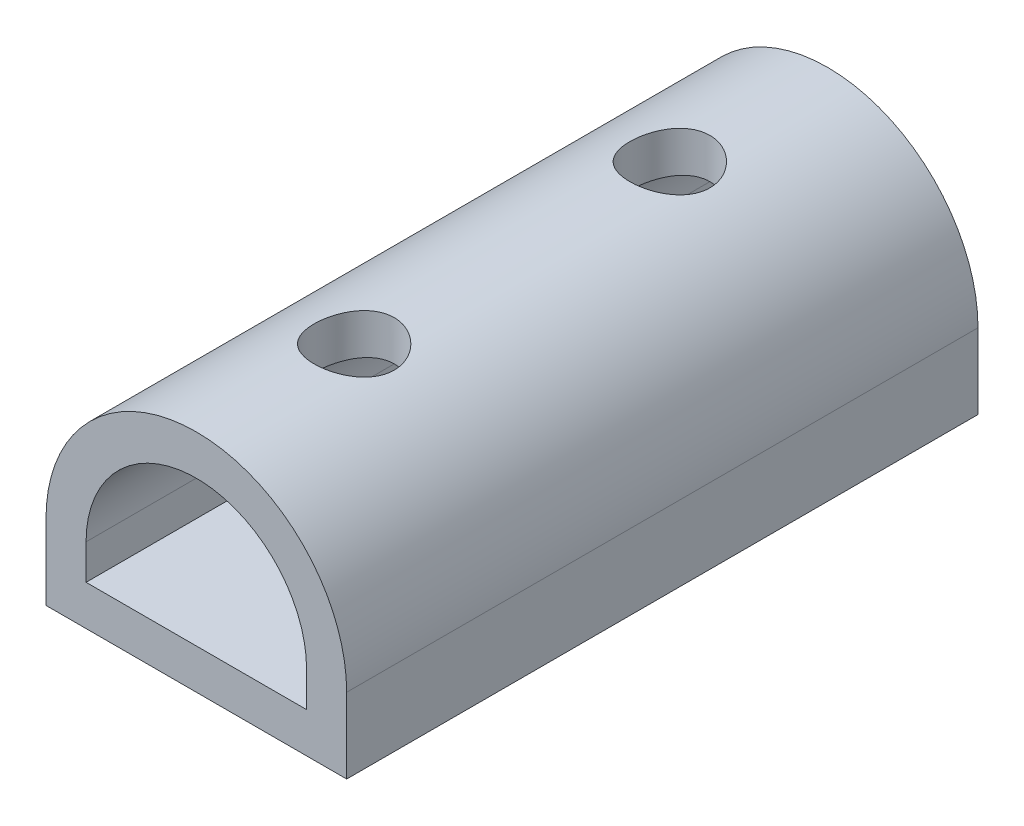
ISO-10303-21;
HEADER;
FILE_DESCRIPTION(('STEP AP214'),'2;1');
FILE_NAME('part.step','',(''),(''),'','','');
FILE_SCHEMA(('AUTOMOTIVE_DESIGN { 1 0 10303 214 1 1 1 1 }'));
ENDSEC;
DATA;
#1=APPLICATION_CONTEXT('core data for automotive mechanical design processes');
#2=APPLICATION_PROTOCOL_DEFINITION('international standard','automotive_design',2000,#1);
#3=PRODUCT_CONTEXT('',#1,'mechanical');
#4=PRODUCT('Part','Part','',(#3));
#5=PRODUCT_RELATED_PRODUCT_CATEGORY('part','',(#4));
#6=PRODUCT_DEFINITION_FORMATION('','',#4);
#7=PRODUCT_DEFINITION_CONTEXT('part definition',#1,'design');
#8=PRODUCT_DEFINITION('design','',#6,#7);
#9=PRODUCT_DEFINITION_SHAPE('','',#8);
#10=(LENGTH_UNIT() NAMED_UNIT(*) SI_UNIT(.MILLI.,.METRE.));
#11=(NAMED_UNIT(*) PLANE_ANGLE_UNIT() SI_UNIT($,.RADIAN.));
#12=(NAMED_UNIT(*) SI_UNIT($,.STERADIAN.) SOLID_ANGLE_UNIT());
#13=UNCERTAINTY_MEASURE_WITH_UNIT(LENGTH_MEASURE(1.E-05),#10,'distance_accuracy_value','');
#14=(GEOMETRIC_REPRESENTATION_CONTEXT(3) GLOBAL_UNCERTAINTY_ASSIGNED_CONTEXT((#13)) GLOBAL_UNIT_ASSIGNED_CONTEXT((#10,
#11,#12)) REPRESENTATION_CONTEXT('',''));
#15=CARTESIAN_POINT('',(0.,0.,0.));
#16=DIRECTION('',(0.,0.,1.));
#17=DIRECTION('',(1.,0.,0.));
#18=AXIS2_PLACEMENT_3D('',#15,#16,#17);
#19=CARTESIAN_POINT('',(0.,0.,20.));
#20=DIRECTION('',(0.,0.,-1.));
#21=DIRECTION('',(-1.,0.,0.));
#22=AXIS2_PLACEMENT_3D('',#19,#20,#21);
#23=PLANE('',#22);
#24=CARTESIAN_POINT('',(0.,0.,20.));
#25=DIRECTION('',(0.,0.,1.));
#26=DIRECTION('',(-1.,0.,0.));
#27=AXIS2_PLACEMENT_3D('',#24,#25,#26);
#28=CIRCLE('',#27,4.7625);
#29=CARTESIAN_POINT('',(4.7625,0.,20.));
#30=VERTEX_POINT('',#29);
#31=CARTESIAN_POINT('',(-4.7625,0.,20.));
#32=VERTEX_POINT('',#31);
#33=EDGE_CURVE('E137',#30,#32,#28,.T.);
#34=ORIENTED_EDGE('',*,*,#33,.T.);
#35=DIRECTION('',(0.,-1.,0.));
#36=VECTOR('',#35,1.);
#37=CARTESIAN_POINT('',(-4.7625,0.,20.));
#38=LINE('',#37,#36);
#39=CARTESIAN_POINT('',(-4.7625,-2.38125,20.));
#40=VERTEX_POINT('',#39);
#41=EDGE_CURVE('E140',#32,#40,#38,.T.);
#42=ORIENTED_EDGE('',*,*,#41,.T.);
#43=DIRECTION('',(1.,0.,0.));
#44=VECTOR('',#43,1.);
#45=CARTESIAN_POINT('',(-4.7625,-2.38125,20.));
#46=LINE('',#45,#44);
#47=CARTESIAN_POINT('',(4.7625,-2.38125,20.));
#48=VERTEX_POINT('',#47);
#49=EDGE_CURVE('E143',#40,#48,#46,.T.);
#50=ORIENTED_EDGE('',*,*,#49,.T.);
#51=DIRECTION('',(0.,1.,0.));
#52=VECTOR('',#51,1.);
#53=CARTESIAN_POINT('',(4.7625,0.,20.));
#54=LINE('',#53,#52);
#55=EDGE_CURVE('E145',#48,#30,#54,.T.);
#56=ORIENTED_EDGE('',*,*,#55,.T.);
#57=EDGE_LOOP('',(#34,#42,#50,#56));
#58=FACE_BOUND('',#57,.T.);
#59=CARTESIAN_POINT('',(0.,0.,20.));
#60=DIRECTION('',(0.,0.,1.));
#61=DIRECTION('',(-1.,0.,0.));
#62=AXIS2_PLACEMENT_3D('',#59,#60,#61);
#63=CIRCLE('',#62,3.4925);
#64=CARTESIAN_POINT('',(3.4925,0.,20.));
#65=VERTEX_POINT('',#64);
#66=CARTESIAN_POINT('',(-3.4925,0.,20.));
#67=VERTEX_POINT('',#66);
#68=EDGE_CURVE('E99',#65,#67,#63,.T.);
#69=ORIENTED_EDGE('',*,*,#68,.F.);
#70=DIRECTION('',(0.,1.,0.));
#71=VECTOR('',#70,1.);
#72=CARTESIAN_POINT('',(3.4925,0.,20.));
#73=LINE('',#72,#71);
#74=CARTESIAN_POINT('',(3.4925,-1.11125,20.));
#75=VERTEX_POINT('',#74);
#76=EDGE_CURVE('E121',#75,#65,#73,.T.);
#77=ORIENTED_EDGE('',*,*,#76,.F.);
#78=DIRECTION('',(1.,0.,0.));
#79=VECTOR('',#78,1.);
#80=CARTESIAN_POINT('',(-3.4925,-1.11125,20.));
#81=LINE('',#80,#79);
#82=CARTESIAN_POINT('',(-3.4925,-1.11125,20.));
#83=VERTEX_POINT('',#82);
#84=EDGE_CURVE('E119',#83,#75,#81,.T.);
#85=ORIENTED_EDGE('',*,*,#84,.F.);
#86=DIRECTION('',(0.,-1.,0.));
#87=VECTOR('',#86,1.);
#88=CARTESIAN_POINT('',(-3.4925,0.,20.));
#89=LINE('',#88,#87);
#90=EDGE_CURVE('E107',#67,#83,#89,.T.);
#91=ORIENTED_EDGE('',*,*,#90,.F.);
#92=EDGE_LOOP('',(#69,#77,#85,#91));
#93=FACE_BOUND('',#92,.T.);
#94=ADVANCED_FACE('F32',(#58,#93),#23,.F.);
#95=CARTESIAN_POINT('',(0.,0.,0.));
#96=DIRECTION('',(0.,0.,-1.));
#97=DIRECTION('',(-1.,0.,0.));
#98=AXIS2_PLACEMENT_3D('',#95,#96,#97);
#99=PLANE('',#98);
#100=CARTESIAN_POINT('',(0.,0.,0.));
#101=DIRECTION('',(0.,0.,1.));
#102=DIRECTION('',(-1.,0.,0.));
#103=AXIS2_PLACEMENT_3D('',#100,#101,#102);
#104=CIRCLE('',#103,4.7625);
#105=CARTESIAN_POINT('',(4.7625,0.,0.));
#106=VERTEX_POINT('',#105);
#107=CARTESIAN_POINT('',(-4.7625,0.,0.));
#108=VERTEX_POINT('',#107);
#109=EDGE_CURVE('E115',#106,#108,#104,.T.);
#110=ORIENTED_EDGE('',*,*,#109,.F.);
#111=DIRECTION('',(0.,1.,0.));
#112=VECTOR('',#111,1.);
#113=CARTESIAN_POINT('',(4.7625,0.,0.));
#114=LINE('',#113,#112);
#115=CARTESIAN_POINT('',(4.7625,-2.38125,0.));
#116=VERTEX_POINT('',#115);
#117=EDGE_CURVE('E141',#116,#106,#114,.T.);
#118=ORIENTED_EDGE('',*,*,#117,.F.);
#119=DIRECTION('',(1.,0.,0.));
#120=VECTOR('',#119,1.);
#121=CARTESIAN_POINT('',(-4.7625,-2.38125,0.));
#122=LINE('',#121,#120);
#123=CARTESIAN_POINT('',(-4.7625,-2.38125,0.));
#124=VERTEX_POINT('',#123);
#125=EDGE_CURVE('E152',#124,#116,#122,.T.);
#126=ORIENTED_EDGE('',*,*,#125,.F.);
#127=DIRECTION('',(0.,-1.,0.));
#128=VECTOR('',#127,1.);
#129=CARTESIAN_POINT('',(-4.7625,0.,0.));
#130=LINE('',#129,#128);
#131=EDGE_CURVE('E150',#108,#124,#130,.T.);
#132=ORIENTED_EDGE('',*,*,#131,.F.);
#133=EDGE_LOOP('',(#110,#118,#126,#132));
#134=FACE_BOUND('',#133,.T.);
#135=DIRECTION('',(0.,1.,0.));
#136=VECTOR('',#135,1.);
#137=CARTESIAN_POINT('',(3.4925,0.,0.));
#138=LINE('',#137,#136);
#139=CARTESIAN_POINT('',(3.4925,-1.11125,0.));
#140=VERTEX_POINT('',#139);
#141=CARTESIAN_POINT('',(3.4925,0.,0.));
#142=VERTEX_POINT('',#141);
#143=EDGE_CURVE('E108',#140,#142,#138,.T.);
#144=ORIENTED_EDGE('',*,*,#143,.T.);
#145=CARTESIAN_POINT('',(0.,0.,0.));
#146=DIRECTION('',(0.,0.,1.));
#147=DIRECTION('',(-1.,0.,0.));
#148=AXIS2_PLACEMENT_3D('',#145,#146,#147);
#149=CIRCLE('',#148,3.4925);
#150=CARTESIAN_POINT('',(-3.4925,0.,0.));
#151=VERTEX_POINT('',#150);
#152=EDGE_CURVE('E57',#142,#151,#149,.T.);
#153=ORIENTED_EDGE('',*,*,#152,.T.);
#154=DIRECTION('',(0.,-1.,0.));
#155=VECTOR('',#154,1.);
#156=CARTESIAN_POINT('',(-3.4925,0.,0.));
#157=LINE('',#156,#155);
#158=CARTESIAN_POINT('',(-3.4925,-1.11125,0.));
#159=VERTEX_POINT('',#158);
#160=EDGE_CURVE('E114',#151,#159,#157,.T.);
#161=ORIENTED_EDGE('',*,*,#160,.T.);
#162=DIRECTION('',(1.,0.,0.));
#163=VECTOR('',#162,1.);
#164=CARTESIAN_POINT('',(-3.4925,-1.11125,0.));
#165=LINE('',#164,#163);
#166=EDGE_CURVE('E129',#159,#140,#165,.T.);
#167=ORIENTED_EDGE('',*,*,#166,.T.);
#168=EDGE_LOOP('',(#144,#153,#161,#167));
#169=FACE_BOUND('',#168,.T.);
#170=ADVANCED_FACE('F218',(#134,#169),#99,.T.);
#171=CARTESIAN_POINT('',(0.,0.,20.));
#172=DIRECTION('',(0.,0.,-1.));
#173=DIRECTION('',(-1.,0.,0.));
#174=AXIS2_PLACEMENT_3D('',#171,#172,#173);
#175=CYLINDRICAL_SURFACE('',#174,4.7625);
#176=CARTESIAN_POINT('',(0.,4.7625,13.730000033));
#177=CARTESIAN_POINT('',(-0.0700116429538607,4.76249894469453,13.7300016947536));
#178=CARTESIAN_POINT('',(-0.140041096740867,4.76094098712968,13.7358087680104));
#179=CARTESIAN_POINT('',(-0.278082661610083,4.75487729249752,13.7588425145191));
#180=CARTESIAN_POINT('',(-0.346093785407618,4.75037013686184,13.7760746833106));
#181=CARTESIAN_POINT('',(-0.478086159043772,4.7389055161553,13.8213585414587));
#182=CARTESIAN_POINT('',(-0.542072481394705,4.73195121127818,13.8493962811679));
#183=CARTESIAN_POINT('',(-0.664434590859336,4.71632723961286,13.9154436820933));
#184=CARTESIAN_POINT('',(-0.722810003735506,4.70765745852329,13.9534540078331));
#185=CARTESIAN_POINT('',(-0.833646734874912,4.68931380462879,14.0392980659225));
#186=CARTESIAN_POINT('',(-0.885959423062883,4.67962276976387,14.0873200371854));
#187=CARTESIAN_POINT('',(-0.981892331745028,4.66043905146116,14.1914218197451));
#188=CARTESIAN_POINT('',(-1.0255114331974,4.65094639369914,14.2475026667866));
#189=CARTESIAN_POINT('',(-1.10354369869575,4.63305866291489,14.3673166621147));
#190=CARTESIAN_POINT('',(-1.13778587362695,4.62468524243723,14.4311647014481));
#191=CARTESIAN_POINT('',(-1.19499093028866,4.61023638090984,14.5639710035418));
#192=CARTESIAN_POINT('',(-1.21795589181525,4.60416051618176,14.6329283213233));
#193=CARTESIAN_POINT('',(-1.2514384434378,4.59517188556697,14.7723496995199));
#194=CARTESIAN_POINT('',(-1.26222550605534,4.59219076442095,14.8427445308696));
#195=CARTESIAN_POINT('',(-1.27188617038369,4.58952492713378,14.9844029619164));
#196=CARTESIAN_POINT('',(-1.27076199813142,4.58983959505736,15.0556663967976));
#197=CARTESIAN_POINT('',(-1.25684603851664,4.59366860518344,15.1949357717615));
#198=CARTESIAN_POINT('',(-1.24438032851112,4.59709352044208,15.2629771435942));
#199=CARTESIAN_POINT('',(-1.20865740438599,4.60661393311852,15.39596592538));
#200=CARTESIAN_POINT('',(-1.18539932778055,4.61270964397422,15.4609130875979));
#201=CARTESIAN_POINT('',(-1.12848616672934,4.62696345208696,15.5867198043184));
#202=CARTESIAN_POINT('',(-1.09471676622492,4.63514403689466,15.6475249884468));
#203=CARTESIAN_POINT('',(-1.017819299281,4.65263375823363,15.7627202238707));
#204=CARTESIAN_POINT('',(-0.974689390623996,4.66194311675655,15.8171090091144));
#205=CARTESIAN_POINT('',(-0.878627956122704,4.68101369249848,15.9197905463838));
#206=CARTESIAN_POINT('',(-0.825422610824696,4.69077974395377,15.96782659513));
#207=CARTESIAN_POINT('',(-0.711592219311044,4.70939102110492,16.0543469085224));
#208=CARTESIAN_POINT('',(-0.650966880820229,4.7182362105024,16.092830796726));
#209=CARTESIAN_POINT('',(-0.523619892240878,4.73406355952908,16.1592674012937));
#210=CARTESIAN_POINT('',(-0.456872913120384,4.74103746249309,16.1871736622349));
#211=CARTESIAN_POINT('',(-0.319406456937899,4.75227678194637,16.2312949978965));
#212=CARTESIAN_POINT('',(-0.248687851574483,4.75654279025931,16.2475126273297));
#213=CARTESIAN_POINT('',(-0.1074763427974,4.76179615684574,16.2673932798428));
#214=CARTESIAN_POINT('',(-0.0370358909022738,4.76287463394061,16.2714053133053));
#215=CARTESIAN_POINT('',(0.103511379147263,4.76189339524225,16.2677247237032));
#216=CARTESIAN_POINT('',(0.173618231034443,4.75983400381017,16.2600333104228));
#217=CARTESIAN_POINT('',(0.310262555687634,4.75286727539979,16.2334504188629));
#218=CARTESIAN_POINT('',(0.376840656037649,4.74800946856943,16.2147536066644));
#219=CARTESIAN_POINT('',(0.505908926696798,4.73599697257755,16.1669167082375));
#220=CARTESIAN_POINT('',(0.56839865315216,4.72884203452476,16.137775490331));
#221=CARTESIAN_POINT('',(0.688872431414171,4.71281544455389,16.0692296146403));
#222=CARTESIAN_POINT('',(0.746744244672928,4.70391290994482,16.0296350915832));
#223=CARTESIAN_POINT('',(0.855144743477116,4.68542022251799,15.9415452478499));
#224=CARTESIAN_POINT('',(0.905671975037205,4.67582993410727,15.8930481690491));
#225=CARTESIAN_POINT('',(0.999419670440502,4.65670738626641,15.7869011912901));
#226=CARTESIAN_POINT('',(1.04239389723741,4.64718439012466,15.7290317465109));
#227=CARTESIAN_POINT('',(1.11802666402443,4.6295719395618,15.6067014509799));
#228=CARTESIAN_POINT('',(1.1506856343717,4.62148242534136,15.5422408753616));
#229=CARTESIAN_POINT('',(1.20451506357419,4.60774585435048,15.408879512999));
#230=CARTESIAN_POINT('',(1.22575200782495,4.60208470249071,15.3400070924606));
#231=CARTESIAN_POINT('',(1.25629165251704,4.5938428902244,15.199492064969));
#232=CARTESIAN_POINT('',(1.26559740277898,4.59126144260366,15.1278501707669));
#233=CARTESIAN_POINT('',(1.27183508429816,4.58953707787145,14.9863508427009));
#234=CARTESIAN_POINT('',(1.26916278817421,4.5902841756238,14.9165119346379));
#235=CARTESIAN_POINT('',(1.25243828760357,4.59487521516067,14.7783193016017));
#236=CARTESIAN_POINT('',(1.23838637599762,4.59871907725366,14.7099655384566));
#237=CARTESIAN_POINT('',(1.19953097469288,4.60900507630243,14.5771816303981));
#238=CARTESIAN_POINT('',(1.17481134782988,4.61542691987149,14.5127252628652));
#239=CARTESIAN_POINT('',(1.11538737147121,4.63014579516798,14.3888259756107));
#240=CARTESIAN_POINT('',(1.08068145575633,4.63844312099654,14.3293838441992));
#241=CARTESIAN_POINT('',(1.00107057385697,4.65628305114601,14.2153112547197));
#242=CARTESIAN_POINT('',(0.955895534026221,4.66585511519549,14.1608738632901));
#243=CARTESIAN_POINT('',(0.857142389795491,4.68500144902234,14.0602238761912));
#244=CARTESIAN_POINT('',(0.803562245017807,4.69457571877017,14.0140132834453));
#245=CARTESIAN_POINT('',(0.688136787991316,4.71289260876513,13.9301569620942));
#246=CARTESIAN_POINT('',(0.626139185712382,4.72161305684738,13.8927156012377));
#247=CARTESIAN_POINT('',(0.496499286664728,4.73699719415342,13.8288457738849));
#248=CARTESIAN_POINT('',(0.428860645132151,4.74366220229083,13.8024102414536));
#249=CARTESIAN_POINT('',(0.301227937599432,4.75332267846052,13.7647502267611));
#250=CARTESIAN_POINT('',(0.241783880518801,4.75673909326302,13.7517491744188));
#251=CARTESIAN_POINT('',(0.121564270026346,4.76132810138149,13.7343737820839));
#252=CARTESIAN_POINT('',(0.0607888487070885,4.76250091628766,13.729998590153));
#253=CARTESIAN_POINT('',(0.,4.7625,13.730000033));
#254=B_SPLINE_CURVE_WITH_KNOTS('',3,(#176,#177,#178,#179,#180,#181,#182,#183,#184,#185,#186,
#187,#188,#189,#190,#191,#192,#193,#194,#195,#196,#197,#198,#199,#200,#201,#202,#203,#204,#205,
#206,#207,#208,#209,#210,#211,#212,#213,#214,#215,#216,#217,#218,#219,#220,#221,#222,#223,#224,
#225,#226,#227,#228,#229,#230,#231,#232,#233,#234,#235,#236,#237,#238,#239,#240,#241,#242,#243,
#244,#245,#246,#247,#248,#249,#250,#251,#252,#253),.UNSPECIFIED.,.T.,.F.,(4,2,2,2,2,2,2,2,2,2,2,
2,2,2,2,2,2,2,2,2,2,2,2,2,2,2,2,2,2,2,2,2,2,2,2,2,2,2,4),(0.,0.209812000332976,
0.419724994788521,0.629367901137178,0.839024780600088,1.05305160201404,1.2671059552747,
1.48483689902251,1.70252767272359,1.91530070487219,2.12803397353037,2.33483786295503,
2.54165828222511,2.75081157571321,2.96000606950989,3.17602399977119,3.39205044176669,
3.60901494094226,3.82593200512032,4.03658525624382,4.24721673363892,4.45422995129038,
4.66126560613809,4.87235681609184,5.08348975840688,5.30057675199365,5.51765468741602,
5.73345499034095,5.9492001199518,6.15787022419844,6.36653495874128,6.57358836053223,
6.78067425366658,6.99385405621383,7.20708568944655,7.4248788019192,7.6425318709574,
7.82472285054319,8.00689583502204),.UNSPECIFIED.);
#255=CARTESIAN_POINT('',(0.,4.7625,13.730000033));
#256=VERTEX_POINT('',#255);
#257=EDGE_CURVE('E164',#256,#256,#254,.T.);
#258=ORIENTED_EDGE('',*,*,#257,.F.);
#259=EDGE_LOOP('',(#258));
#260=FACE_BOUND('',#259,.T.);
#261=CARTESIAN_POINT('',(0.,4.7625,3.729999967));
#262=CARTESIAN_POINT('',(-0.0700116429538588,4.76249894469453,3.73000162875363));
#263=CARTESIAN_POINT('',(-0.140041096740865,4.76094098712968,3.73580870201044));
#264=CARTESIAN_POINT('',(-0.278082661610081,4.75487729249752,3.75884244851907));
#265=CARTESIAN_POINT('',(-0.346093785407616,4.75037013686184,3.77607461731058));
#266=CARTESIAN_POINT('',(-0.47808615904377,4.7389055161553,3.82135847545866));
#267=CARTESIAN_POINT('',(-0.542072481394703,4.73195121127818,3.84939621516793));
#268=CARTESIAN_POINT('',(-0.664434590859333,4.71632723961286,3.91544361609329));
#269=CARTESIAN_POINT('',(-0.722810003735504,4.70765745852329,3.95345394183311));
#270=CARTESIAN_POINT('',(-0.833646734874911,4.68931380462879,4.03929799992252));
#271=CARTESIAN_POINT('',(-0.885959423062882,4.67962276976387,4.08731997118538));
#272=CARTESIAN_POINT('',(-0.981892331745028,4.66043905146116,4.1914217537451));
#273=CARTESIAN_POINT('',(-1.0255114331974,4.65094639369914,4.24750260078663));
#274=CARTESIAN_POINT('',(-1.10354369869575,4.63305866291489,4.36731659611467));
#275=CARTESIAN_POINT('',(-1.13778587362694,4.62468524243723,4.4311646354481));
#276=CARTESIAN_POINT('',(-1.19499093028865,4.61023638090984,4.56397093754178));
#277=CARTESIAN_POINT('',(-1.21795589181524,4.60416051618176,4.63292825532334));
#278=CARTESIAN_POINT('',(-1.2514384434378,4.59517188556697,4.77234963351992));
#279=CARTESIAN_POINT('',(-1.26222550605534,4.59219076442095,4.84274446486962));
#280=CARTESIAN_POINT('',(-1.27188617038368,4.58952492713378,4.9844028959164));
#281=CARTESIAN_POINT('',(-1.27076199813142,4.58983959505736,5.05566633079762));
#282=CARTESIAN_POINT('',(-1.25684603851664,4.59366860518344,5.19493570576146));
#283=CARTESIAN_POINT('',(-1.24438032851112,4.59709352044208,5.26297707759415));
#284=CARTESIAN_POINT('',(-1.20865740438599,4.60661393311852,5.39596585938));
#285=CARTESIAN_POINT('',(-1.18539932778055,4.61270964397422,5.46091302159792));
#286=CARTESIAN_POINT('',(-1.12848616672933,4.62696345208696,5.58671973831837));
#287=CARTESIAN_POINT('',(-1.09471676622492,4.63514403689466,5.64752492244675));
#288=CARTESIAN_POINT('',(-1.01781929928099,4.65263375823363,5.76272015787074));
#289=CARTESIAN_POINT('',(-0.974689390623995,4.66194311675655,5.81710894311436));
#290=CARTESIAN_POINT('',(-0.878627956122704,4.68101369249848,5.91979048038379));
#291=CARTESIAN_POINT('',(-0.825422610824694,4.69077974395377,5.96782652912999));
#292=CARTESIAN_POINT('',(-0.711592219311043,4.70939102110492,6.05434684252243));
#293=CARTESIAN_POINT('',(-0.650966880820228,4.7182362105024,6.09283073072604));
#294=CARTESIAN_POINT('',(-0.523619892240877,4.73406355952908,6.15926733529365));
#295=CARTESIAN_POINT('',(-0.456872913120382,4.74103746249309,6.18717359623486));
#296=CARTESIAN_POINT('',(-0.319406456937897,4.75227678194637,6.23129493189649));
#297=CARTESIAN_POINT('',(-0.248687851574481,4.75654279025931,6.24751256132971));
#298=CARTESIAN_POINT('',(-0.107476342797398,4.76179615684574,6.26739321384282));
#299=CARTESIAN_POINT('',(-0.037035890902272,4.76287463394061,6.2714052473053));
#300=CARTESIAN_POINT('',(0.103511379147265,4.76189339524225,6.26772465770319));
#301=CARTESIAN_POINT('',(0.173618231034445,4.75983400381017,6.26003324442284));
#302=CARTESIAN_POINT('',(0.310262555687635,4.75286727539979,6.23345035286291));
#303=CARTESIAN_POINT('',(0.37684065603765,4.74800946856943,6.2147535406644));
#304=CARTESIAN_POINT('',(0.5059089266968,4.73599697257755,6.16691664223747));
#305=CARTESIAN_POINT('',(0.568398653152162,4.72884203452476,6.13777542433096));
#306=CARTESIAN_POINT('',(0.688872431414172,4.71281544455389,6.0692295486403));
#307=CARTESIAN_POINT('',(0.746744244672929,4.70391290994482,6.02963502558321));
#308=CARTESIAN_POINT('',(0.855144743477117,4.68542022251799,5.94154518184989));
#309=CARTESIAN_POINT('',(0.905671975037205,4.67582993410727,5.89304810304914));
#310=CARTESIAN_POINT('',(0.999419670440503,4.65670738626641,5.78690112529012));
#311=CARTESIAN_POINT('',(1.04239389723741,4.64718439012466,5.72903168051091));
#312=CARTESIAN_POINT('',(1.11802666402443,4.6295719395618,5.6067013849799));
#313=CARTESIAN_POINT('',(1.1506856343717,4.62148242534136,5.54224080936163));
#314=CARTESIAN_POINT('',(1.20451506357419,4.60774585435048,5.40887944699899));
#315=CARTESIAN_POINT('',(1.22575200782495,4.60208470249071,5.34000702646057));
#316=CARTESIAN_POINT('',(1.25629165251704,4.5938428902244,5.19949199896902));
#317=CARTESIAN_POINT('',(1.26559740277898,4.59126144260366,5.12785010476691));
#318=CARTESIAN_POINT('',(1.27183508429816,4.58953707787145,4.98635077670093));
#319=CARTESIAN_POINT('',(1.26916278817421,4.5902841756238,4.9165118686379));
#320=CARTESIAN_POINT('',(1.25243828760357,4.59487521516067,4.77831923560172));
#321=CARTESIAN_POINT('',(1.23838637599762,4.59871907725365,4.70996547245662));
#322=CARTESIAN_POINT('',(1.19953097469289,4.60900507630243,4.57718156439805));
#323=CARTESIAN_POINT('',(1.17481134782988,4.61542691987149,4.5127251968652));
#324=CARTESIAN_POINT('',(1.11538737147121,4.63014579516798,4.38882590961068));
#325=CARTESIAN_POINT('',(1.08068145575633,4.63844312099654,4.32938377819915));
#326=CARTESIAN_POINT('',(1.00107057385697,4.65628305114601,4.21531118871969));
#327=CARTESIAN_POINT('',(0.955895534026224,4.66585511519549,4.16087379729011));
#328=CARTESIAN_POINT('',(0.857142389795493,4.68500144902234,4.06022381019124));
#329=CARTESIAN_POINT('',(0.803562245017809,4.69457571877017,4.01401321744528));
#330=CARTESIAN_POINT('',(0.688136787991317,4.71289260876513,3.93015689609425));
#331=CARTESIAN_POINT('',(0.626139185712383,4.72161305684738,3.89271553523768));
#332=CARTESIAN_POINT('',(0.496499286664728,4.73699719415342,3.82884570788485));
#333=CARTESIAN_POINT('',(0.428860645132152,4.74366220229083,3.80241017545361));
#334=CARTESIAN_POINT('',(0.301227937599433,4.75332267846052,3.76475016076115));
#335=CARTESIAN_POINT('',(0.241783880518801,4.75673909326302,3.75174910841877));
#336=CARTESIAN_POINT('',(0.121564270026347,4.76132810138149,3.73437371608392));
#337=CARTESIAN_POINT('',(0.0607888487070899,4.76250091628766,3.72999852415298));
#338=CARTESIAN_POINT('',(0.,4.7625,3.729999967));
#339=B_SPLINE_CURVE_WITH_KNOTS('',3,(#261,#262,#263,#264,#265,#266,#267,#268,#269,#270,#271,
#272,#273,#274,#275,#276,#277,#278,#279,#280,#281,#282,#283,#284,#285,#286,#287,#288,#289,#290,
#291,#292,#293,#294,#295,#296,#297,#298,#299,#300,#301,#302,#303,#304,#305,#306,#307,#308,#309,
#310,#311,#312,#313,#314,#315,#316,#317,#318,#319,#320,#321,#322,#323,#324,#325,#326,#327,#328,
#329,#330,#331,#332,#333,#334,#335,#336,#337,#338),.UNSPECIFIED.,.T.,.F.,(4,2,2,2,2,2,2,2,2,2,2,
2,2,2,2,2,2,2,2,2,2,2,2,2,2,2,2,2,2,2,2,2,2,2,2,2,2,2,4),(0.,0.209812000332976,
0.419724994788521,0.629367901137176,0.839024780600087,1.05305160201404,1.26710595527469,
1.4848368990225,1.70252767272359,1.91530070487219,2.12803397353037,2.33483786295502,
2.54165828222511,2.75081157571321,2.96000606950989,3.17602399977119,3.39205044176669,
3.60901494094226,3.82593200512032,4.03658525624382,4.24721673363892,4.45422995129038,
4.66126560613809,4.87235681609184,5.08348975840687,5.30057675199365,5.51765468741602,
5.73345499034095,5.9492001199518,6.15787022419844,6.36653495874128,6.57358836053223,
6.78067425366657,6.99385405621383,7.20708568944655,7.4248788019192,7.6425318709574,
7.82472285054319,8.00689583502204),.UNSPECIFIED.);
#340=CARTESIAN_POINT('',(0.,4.7625,3.729999967));
#341=VERTEX_POINT('',#340);
#342=EDGE_CURVE('E175',#341,#341,#339,.T.);
#343=ORIENTED_EDGE('',*,*,#342,.F.);
#344=EDGE_LOOP('',(#343));
#345=FACE_BOUND('',#344,.T.);
#346=ORIENTED_EDGE('',*,*,#109,.T.);
#347=DIRECTION('',(0.,0.,-1.));
#348=VECTOR('',#347,1.);
#349=CARTESIAN_POINT('',(-4.7625,0.,20.));
#350=LINE('',#349,#348);
#351=EDGE_CURVE('E11',#32,#108,#350,.T.);
#352=ORIENTED_EDGE('',*,*,#351,.F.);
#353=ORIENTED_EDGE('',*,*,#33,.F.);
#354=DIRECTION('',(0.,0.,-1.));
#355=VECTOR('',#354,1.);
#356=CARTESIAN_POINT('',(4.7625,0.,20.));
#357=LINE('',#356,#355);
#358=EDGE_CURVE('E147',#30,#106,#357,.T.);
#359=ORIENTED_EDGE('',*,*,#358,.T.);
#360=EDGE_LOOP('',(#346,#352,#353,#359));
#361=FACE_BOUND('',#360,.T.);
#362=ADVANCED_FACE('F34',(#260,#345,#361),#175,.T.);
#363=CARTESIAN_POINT('',(-4.7625,0.,20.));
#364=DIRECTION('',(1.,0.,0.));
#365=DIRECTION('',(0.,0.,-1.));
#366=AXIS2_PLACEMENT_3D('',#363,#364,#365);
#367=PLANE('',#366);
#368=ORIENTED_EDGE('',*,*,#131,.T.);
#369=DIRECTION('',(0.,0.,-1.));
#370=VECTOR('',#369,1.);
#371=CARTESIAN_POINT('',(-4.7625,-2.38125,20.));
#372=LINE('',#371,#370);
#373=EDGE_CURVE('E41',#40,#124,#372,.T.);
#374=ORIENTED_EDGE('',*,*,#373,.F.);
#375=ORIENTED_EDGE('',*,*,#41,.F.);
#376=ORIENTED_EDGE('',*,*,#351,.T.);
#377=EDGE_LOOP('',(#368,#374,#375,#376));
#378=FACE_BOUND('',#377,.T.);
#379=ADVANCED_FACE('F228',(#378),#367,.F.);
#380=CARTESIAN_POINT('',(-4.7625,-2.38125,20.));
#381=DIRECTION('',(0.,1.,0.));
#382=DIRECTION('',(0.,0.,1.));
#383=AXIS2_PLACEMENT_3D('',#380,#381,#382);
#384=PLANE('',#383);
#385=CARTESIAN_POINT('',(0.,-2.38125,15.000000033));
#386=DIRECTION('',(0.,-1.,0.));
#387=DIRECTION('',(0.,0.,-1.));
#388=AXIS2_PLACEMENT_3D('',#385,#386,#387);
#389=CIRCLE('',#388,1.27);
#390=CARTESIAN_POINT('',(0.,-2.38125,13.730000033));
#391=VERTEX_POINT('',#390);
#392=EDGE_CURVE('E170',#391,#391,#389,.T.);
#393=ORIENTED_EDGE('',*,*,#392,.F.);
#394=EDGE_LOOP('',(#393));
#395=FACE_BOUND('',#394,.T.);
#396=CARTESIAN_POINT('',(0.,-2.38125,4.999999967));
#397=DIRECTION('',(0.,-1.,0.));
#398=DIRECTION('',(0.,0.,-1.));
#399=AXIS2_PLACEMENT_3D('',#396,#397,#398);
#400=CIRCLE('',#399,1.27);
#401=CARTESIAN_POINT('',(0.,-2.38125,3.729999967));
#402=VERTEX_POINT('',#401);
#403=EDGE_CURVE('E183',#402,#402,#400,.T.);
#404=ORIENTED_EDGE('',*,*,#403,.F.);
#405=EDGE_LOOP('',(#404));
#406=FACE_BOUND('',#405,.T.);
#407=ORIENTED_EDGE('',*,*,#125,.T.);
#408=DIRECTION('',(0.,0.,-1.));
#409=VECTOR('',#408,1.);
#410=CARTESIAN_POINT('',(4.7625,-2.38125,20.));
#411=LINE('',#410,#409);
#412=EDGE_CURVE('E157',#48,#116,#411,.T.);
#413=ORIENTED_EDGE('',*,*,#412,.F.);
#414=ORIENTED_EDGE('',*,*,#49,.F.);
#415=ORIENTED_EDGE('',*,*,#373,.T.);
#416=EDGE_LOOP('',(#407,#413,#414,#415));
#417=FACE_BOUND('',#416,.T.);
#418=ADVANCED_FACE('F225',(#395,#406,#417),#384,.F.);
#419=CARTESIAN_POINT('',(4.7625,0.,20.));
#420=DIRECTION('',(-1.,0.,0.));
#421=DIRECTION('',(0.,0.,1.));
#422=AXIS2_PLACEMENT_3D('',#419,#420,#421);
#423=PLANE('',#422);
#424=ORIENTED_EDGE('',*,*,#117,.T.);
#425=ORIENTED_EDGE('',*,*,#358,.F.);
#426=ORIENTED_EDGE('',*,*,#55,.F.);
#427=ORIENTED_EDGE('',*,*,#412,.T.);
#428=EDGE_LOOP('',(#424,#425,#426,#427));
#429=FACE_BOUND('',#428,.T.);
#430=ADVANCED_FACE('F212',(#429),#423,.F.);
#431=CARTESIAN_POINT('',(0.,0.,20.));
#432=DIRECTION('',(0.,0.,-1.));
#433=DIRECTION('',(-1.,0.,0.));
#434=AXIS2_PLACEMENT_3D('',#431,#432,#433);
#435=CYLINDRICAL_SURFACE('',#434,3.4925);
#436=CARTESIAN_POINT('',(0.,3.4925,13.730000033));
#437=CARTESIAN_POINT('',(0.0689249111878132,3.49250130592312,13.729998246792));
#438=CARTESIAN_POINT('',(0.137837250389312,3.49044157245854,13.7356287966636));
#439=CARTESIAN_POINT('',(0.273610573760271,3.48242983667675,13.7579174620315));
#440=CARTESIAN_POINT('',(0.340471715138098,3.47647813343291,13.7745747301952));
#441=CARTESIAN_POINT('',(0.470165408069924,3.46132356802955,13.8182553250225));
#442=CARTESIAN_POINT('',(0.533005191367282,3.45212674753601,13.8452593962756));
#443=CARTESIAN_POINT('',(0.653260195166903,3.43140428208539,13.9087721850524));
#444=CARTESIAN_POINT('',(0.710674052723575,3.41987805427124,13.9452832820554));
#445=CARTESIAN_POINT('',(0.820760963191796,3.39517411199561,14.0283128623228));
#446=CARTESIAN_POINT('',(0.873186041193446,3.3819516155397,14.0751466932977));
#447=CARTESIAN_POINT('',(0.969634834675517,3.35557287216139,14.1768227034874));
#448=CARTESIAN_POINT('',(1.01365619662407,3.34241664479966,14.2316671185657));
#449=CARTESIAN_POINT('',(1.09357821012795,3.3171471985485,14.3501759894389));
#450=CARTESIAN_POINT('',(1.12913655263858,3.30508733105423,14.4140838008397));
#451=CARTESIAN_POINT('',(1.18889106544449,3.28406837834447,14.5474809202788));
#452=CARTESIAN_POINT('',(1.21309146633198,3.27510813891081,14.616968138794));
#453=CARTESIAN_POINT('',(1.24847779479367,3.26177965562232,14.7567052800353));
#454=CARTESIAN_POINT('',(1.26013474801189,3.25724585799778,14.8268196171645));
#455=CARTESIAN_POINT('',(1.27157618527365,3.25279751723428,14.9681444679139));
#456=CARTESIAN_POINT('',(1.27136520421606,3.25288120968942,15.0393545524357));
#457=CARTESIAN_POINT('',(1.25943847532162,3.25751498015266,15.1766266816098));
#458=CARTESIAN_POINT('',(1.24836462431205,3.26181585514961,15.2427544403244));
#459=CARTESIAN_POINT('',(1.21608368703509,3.27398704361995,15.3721395361715));
#460=CARTESIAN_POINT('',(1.19487516647304,3.28185786231652,15.4353964656261));
#461=CARTESIAN_POINT('',(1.14255580828119,3.30043972443938,15.5585945232394));
#462=CARTESIAN_POINT('',(1.11127191067819,3.31119981448247,15.6184544349287));
#463=CARTESIAN_POINT('',(1.03981025567231,3.33433030070334,15.732266000233));
#464=CARTESIAN_POINT('',(0.999629560664636,3.34670122820129,15.786215693557));
#465=CARTESIAN_POINT('',(0.908536892242233,3.37260926922204,15.8902444485355));
#466=CARTESIAN_POINT('',(0.857108920926717,3.38617079332249,15.9398666533071));
#467=CARTESIAN_POINT('',(0.746501477698888,3.41225981148832,16.029913524664));
#468=CARTESIAN_POINT('',(0.687320954199663,3.4247871648982,16.0703369414496));
#469=CARTESIAN_POINT('',(0.561779091373625,3.44761959505864,16.1413027811821));
#470=CARTESIAN_POINT('',(0.495330124669236,3.45789171007814,16.1717015395663));
#471=CARTESIAN_POINT('',(0.357795778643102,3.47481347640336,16.2207399985615));
#472=CARTESIAN_POINT('',(0.286712344246684,3.48146463647985,16.23938459738));
#473=CARTESIAN_POINT('',(0.145778326268969,3.49013417391845,16.263526851302));
#474=CARTESIAN_POINT('',(0.0760464499738089,3.49236933519615,16.269640282953));
#475=CARTESIAN_POINT('',(-0.0634740498123814,3.49261935027409,16.2703286678384));
#476=CARTESIAN_POINT('',(-0.133262658636845,3.4906350742267,16.2649060001019));
#477=CARTESIAN_POINT('',(-0.268310525564105,3.48281239069831,16.2431500699259));
#478=CARTESIAN_POINT('',(-0.333642547463424,3.47711400862096,16.2272129553415));
#479=CARTESIAN_POINT('',(-0.460665303011011,3.46257618907898,16.1853946293349));
#480=CARTESIAN_POINT('',(-0.522355561855574,3.45373634308842,16.1595121245471));
#481=CARTESIAN_POINT('',(-0.642322043008988,3.433480380613,16.0977273544698));
#482=CARTESIAN_POINT('',(-0.700449725182725,3.42199768275278,16.0615591559187));
#483=CARTESIAN_POINT('',(-0.81000007993093,3.39773591835121,15.9805333145841));
#484=CARTESIAN_POINT('',(-0.861420376008897,3.38495639516714,15.9356726058708));
#485=CARTESIAN_POINT('',(-0.959022434338151,3.3586494952659,15.8356550875246));
#486=CARTESIAN_POINT('',(-1.0047662073334,3.34511930451886,15.7800705085893));
#487=CARTESIAN_POINT('',(-1.08635425446788,3.31952173720375,15.6617392585077));
#488=CARTESIAN_POINT('',(-1.12219790894798,3.30745445222705,15.5989921393976));
#489=CARTESIAN_POINT('',(-1.18293632596333,3.28622291239473,15.4677582115065));
#490=CARTESIAN_POINT('',(-1.20780785697879,3.27706482861489,15.3992595862434));
#491=CARTESIAN_POINT('',(-1.24551411218445,3.26292265657178,15.258624453589));
#492=CARTESIAN_POINT('',(-1.2583556844669,3.25793619377317,15.1864900405581));
#493=CARTESIAN_POINT('',(-1.27104585171653,3.25300484888385,15.0453445523189));
#494=CARTESIAN_POINT('',(-1.27163556307265,3.25277240957635,14.9764095494853));
#495=CARTESIAN_POINT('',(-1.26168297666313,3.25664555029759,14.8394786581117));
#496=CARTESIAN_POINT('',(-1.25114160968835,3.26075076760758,14.7714826915302));
#497=CARTESIAN_POINT('',(-1.21978944468269,3.27260405673642,14.6402122361084));
#498=CARTESIAN_POINT('',(-1.19926324553954,3.2802509072833,14.5768598714096));
#499=CARTESIAN_POINT('',(-1.14876848356154,3.29827263524212,14.4544570676429));
#500=CARTESIAN_POINT('',(-1.11879760515688,3.30864818155023,14.395407687922));
#501=CARTESIAN_POINT('',(-1.0485192894684,3.33160522733576,14.280074209583));
#502=CARTESIAN_POINT('',(-1.00776929775471,3.34427118962352,14.2240767714228));
#503=CARTESIAN_POINT('',(-0.917791995292093,3.37007454955794,14.119477186684));
#504=CARTESIAN_POINT('',(-0.868562073702484,3.38321209140766,14.0708773264129));
#505=CARTESIAN_POINT('',(-0.760097348853396,3.4092616990446,13.9799998719064));
#506=CARTESIAN_POINT('',(-0.700487203308727,3.42213019694382,13.9381558906251));
#507=CARTESIAN_POINT('',(-0.574634263398638,3.44549604837881,13.8651044900119));
#508=CARTESIAN_POINT('',(-0.508391613680605,3.45599345360918,13.8338968387792));
#509=CARTESIAN_POINT('',(-0.369838488606168,3.47357638867193,13.7827623939007));
#510=CARTESIAN_POINT('',(-0.297439626412911,3.48059645447951,13.7630508914743));
#511=CARTESIAN_POINT('',(-0.15002145715964,3.49005657004603,13.7366734730442));
#512=CARTESIAN_POINT('',(-0.0750032849966774,3.49249857890968,13.7300019767307));
#513=CARTESIAN_POINT('',(0.,3.4925,13.730000033));
#514=B_SPLINE_CURVE_WITH_KNOTS('',3,(#436,#437,#438,#439,#440,#441,#442,#443,#444,#445,#446,
#447,#448,#449,#450,#451,#452,#453,#454,#455,#456,#457,#458,#459,#460,#461,#462,#463,#464,#465,
#466,#467,#468,#469,#470,#471,#472,#473,#474,#475,#476,#477,#478,#479,#480,#481,#482,#483,#484,
#485,#486,#487,#488,#489,#490,#491,#492,#493,#494,#495,#496,#497,#498,#499,#500,#501,#502,#503,
#504,#505,#506,#507,#508,#509,#510,#511,#512,#513),.UNSPECIFIED.,.T.,.F.,(4,2,2,2,2,2,2,2,2,2,2,
2,2,2,2,2,2,2,2,2,2,2,2,2,2,2,2,2,2,2,2,2,2,2,2,2,2,2,4),(0.,0.206498256126634,
0.412980646027176,0.619080623862527,0.825232235385794,1.03887247244046,1.25257245375897,
1.47383113979724,1.69500734613459,1.90755231326651,2.1200160646321,2.32063772011415,
2.52128777670272,2.72558665177081,2.92995308448528,3.14717315033033,3.3644227113349,
3.58466258304543,3.80481061536218,4.01385281421983,4.22285190758564,4.42439475610885,
4.62596382349969,4.83331049087686,5.04073042492914,5.25945011627047,5.47818349441333,
5.69737780444605,5.91644726146364,6.12222385212772,6.32798323692921,6.52819396047389,
6.72845380829864,6.93874449092986,7.1491000349513,7.36989799263775,7.59069113601981,
7.81549635518722,8.04020535065303),.UNSPECIFIED.);
#515=CARTESIAN_POINT('',(0.,3.4925,13.730000033));
#516=VERTEX_POINT('',#515);
#517=EDGE_CURVE('E127',#516,#516,#514,.T.);
#518=ORIENTED_EDGE('',*,*,#517,.F.);
#519=EDGE_LOOP('',(#518));
#520=FACE_BOUND('',#519,.T.);
#521=CARTESIAN_POINT('',(0.,3.4925,3.729999967));
#522=CARTESIAN_POINT('',(0.068924911187815,3.49250130592312,3.72999818079198));
#523=CARTESIAN_POINT('',(0.137837250389313,3.49044157245854,3.73562873066359));
#524=CARTESIAN_POINT('',(0.273610573760273,3.48242983667675,3.7579173960315));
#525=CARTESIAN_POINT('',(0.3404717151381,3.47647813343291,3.77457466419517));
#526=CARTESIAN_POINT('',(0.470165408069926,3.46132356802955,3.81825525902245));
#527=CARTESIAN_POINT('',(0.533005191367284,3.45212674753601,3.84525933027558));
#528=CARTESIAN_POINT('',(0.653260195166905,3.43140428208539,3.90877211905243));
#529=CARTESIAN_POINT('',(0.710674052723577,3.41987805427124,3.9452832160554));
#530=CARTESIAN_POINT('',(0.820760963191798,3.39517411199561,4.02831279632282));
#531=CARTESIAN_POINT('',(0.873186041193448,3.3819516155397,4.0751466272977));
#532=CARTESIAN_POINT('',(0.969634834675519,3.35557287216139,4.17682263748742));
#533=CARTESIAN_POINT('',(1.01365619662407,3.34241664479966,4.2316670525657));
#534=CARTESIAN_POINT('',(1.09357821012795,3.3171471985485,4.35017592343887));
#535=CARTESIAN_POINT('',(1.12913655263858,3.30508733105423,4.41408373483973));
#536=CARTESIAN_POINT('',(1.18889106544449,3.28406837834447,4.5474808542788));
#537=CARTESIAN_POINT('',(1.21309146633199,3.27510813891081,4.61696807279405));
#538=CARTESIAN_POINT('',(1.24847779479368,3.26177965562232,4.75670521403528));
#539=CARTESIAN_POINT('',(1.26013474801189,3.25724585799778,4.8268195511645));
#540=CARTESIAN_POINT('',(1.27157618527366,3.25279751723428,4.96814440191389));
#541=CARTESIAN_POINT('',(1.27136520421606,3.25288120968942,5.03935448643568));
#542=CARTESIAN_POINT('',(1.25943847532162,3.25751498015266,5.17662661560978));
#543=CARTESIAN_POINT('',(1.24836462431205,3.26181585514961,5.24275437432439));
#544=CARTESIAN_POINT('',(1.21608368703509,3.27398704361995,5.37213947017153));
#545=CARTESIAN_POINT('',(1.19487516647304,3.28185786231652,5.43539639962612));
#546=CARTESIAN_POINT('',(1.1425558082812,3.30043972443938,5.55859445723942));
#547=CARTESIAN_POINT('',(1.11127191067819,3.31119981448247,5.61845436892866));
#548=CARTESIAN_POINT('',(1.03981025567231,3.33433030070334,5.73226593423303));
#549=CARTESIAN_POINT('',(0.999629560664637,3.34670122820129,5.786215627557));
#550=CARTESIAN_POINT('',(0.908536892242234,3.37260926922204,5.89024438253547));
#551=CARTESIAN_POINT('',(0.857108920926719,3.38617079332249,5.9398665873071));
#552=CARTESIAN_POINT('',(0.746501477698889,3.41225981148832,6.02991345866404));
#553=CARTESIAN_POINT('',(0.687320954199663,3.4247871648982,6.07033687544955));
#554=CARTESIAN_POINT('',(0.561779091373625,3.44761959505864,6.14130271518207));
#555=CARTESIAN_POINT('',(0.495330124669236,3.45789171007814,6.17170147356626));
#556=CARTESIAN_POINT('',(0.357795778643103,3.47481347640336,6.22073993256153));
#557=CARTESIAN_POINT('',(0.286712344246685,3.48146463647985,6.23938453137998));
#558=CARTESIAN_POINT('',(0.14577832626897,3.49013417391845,6.26352678530202));
#559=CARTESIAN_POINT('',(0.0760464499738106,3.49236933519615,6.269640216953));
#560=CARTESIAN_POINT('',(-0.0634740498123797,3.49261935027409,6.27032860183843));
#561=CARTESIAN_POINT('',(-0.133262658636843,3.4906350742267,6.26490593410187));
#562=CARTESIAN_POINT('',(-0.268310525564103,3.48281239069831,6.2431500039259));
#563=CARTESIAN_POINT('',(-0.333642547463422,3.47711400862096,6.22721288934151));
#564=CARTESIAN_POINT('',(-0.46066530301101,3.46257618907898,6.18539456333494));
#565=CARTESIAN_POINT('',(-0.522355561855573,3.45373634308842,6.15951205854709));
#566=CARTESIAN_POINT('',(-0.642322043008987,3.433480380613,6.09772728846976));
#567=CARTESIAN_POINT('',(-0.700449725182723,3.42199768275278,6.06155908991865));
#568=CARTESIAN_POINT('',(-0.810000079930928,3.39773591835121,5.9805332485841));
#569=CARTESIAN_POINT('',(-0.861420376008895,3.38495639516714,5.93567253987084));
#570=CARTESIAN_POINT('',(-0.95902243433815,3.3586494952659,5.83565502152463));
#571=CARTESIAN_POINT('',(-1.0047662073334,3.34511930451886,5.78007044258926));
#572=CARTESIAN_POINT('',(-1.08635425446788,3.31952173720375,5.6617391925077));
#573=CARTESIAN_POINT('',(-1.12219790894798,3.30745445222705,5.5989920733976));
#574=CARTESIAN_POINT('',(-1.18293632596333,3.28622291239473,5.46775814550646));
#575=CARTESIAN_POINT('',(-1.20780785697879,3.27706482861489,5.39925952024344));
#576=CARTESIAN_POINT('',(-1.24551411218445,3.26292265657178,5.25862438758897));
#577=CARTESIAN_POINT('',(-1.2583556844669,3.25793619377317,5.18648997455808));
#578=CARTESIAN_POINT('',(-1.27104585171652,3.25300484888386,5.04534448631888));
#579=CARTESIAN_POINT('',(-1.27163556307265,3.25277240957635,4.97640948348531));
#580=CARTESIAN_POINT('',(-1.26168297666313,3.25664555029759,4.83947859211167));
#581=CARTESIAN_POINT('',(-1.25114160968835,3.26075076760758,4.77148262553017));
#582=CARTESIAN_POINT('',(-1.21978944468269,3.27260405673642,4.64021217010841));
#583=CARTESIAN_POINT('',(-1.19926324553953,3.2802509072833,4.57685980540957));
#584=CARTESIAN_POINT('',(-1.14876848356154,3.29827263524212,4.45445700164291));
#585=CARTESIAN_POINT('',(-1.11879760515687,3.30864818155023,4.39540762192196));
#586=CARTESIAN_POINT('',(-1.0485192894684,3.33160522733576,4.28007414358301));
#587=CARTESIAN_POINT('',(-1.00776929775471,3.34427118962352,4.2240767054228));
#588=CARTESIAN_POINT('',(-0.91779199529209,3.37007454955794,4.11947712068403));
#589=CARTESIAN_POINT('',(-0.868562073702481,3.38321209140766,4.07087726041293));
#590=CARTESIAN_POINT('',(-0.760097348853394,3.4092616990446,3.97999980590644));
#591=CARTESIAN_POINT('',(-0.700487203308725,3.42213019694382,3.93815582462508));
#592=CARTESIAN_POINT('',(-0.574634263398636,3.44549604837881,3.86510442401194));
#593=CARTESIAN_POINT('',(-0.508391613680602,3.45599345360918,3.83389677277922));
#594=CARTESIAN_POINT('',(-0.369838488606166,3.47357638867193,3.78276232790071));
#595=CARTESIAN_POINT('',(-0.297439626412909,3.48059645447951,3.76305082547427));
#596=CARTESIAN_POINT('',(-0.150021457159638,3.49005657004603,3.73667340704418));
#597=CARTESIAN_POINT('',(-0.0750032849966754,3.49249857890968,3.73000191073075));
#598=CARTESIAN_POINT('',(0.,3.4925,3.729999967));
#599=B_SPLINE_CURVE_WITH_KNOTS('',3,(#521,#522,#523,#524,#525,#526,#527,#528,#529,#530,#531,
#532,#533,#534,#535,#536,#537,#538,#539,#540,#541,#542,#543,#544,#545,#546,#547,#548,#549,#550,
#551,#552,#553,#554,#555,#556,#557,#558,#559,#560,#561,#562,#563,#564,#565,#566,#567,#568,#569,
#570,#571,#572,#573,#574,#575,#576,#577,#578,#579,#580,#581,#582,#583,#584,#585,#586,#587,#588,
#589,#590,#591,#592,#593,#594,#595,#596,#597,#598),.UNSPECIFIED.,.T.,.F.,(4,2,2,2,2,2,2,2,2,2,2,
2,2,2,2,2,2,2,2,2,2,2,2,2,2,2,2,2,2,2,2,2,2,2,2,2,2,2,4),(0.,0.206498256126634,
0.412980646027176,0.619080623862527,0.825232235385794,1.03887247244047,1.25257245375896,
1.47383113979724,1.69500734613459,1.9075523132665,2.12001606463209,2.32063772011415,
2.52128777670272,2.72558665177081,2.92995308448528,3.14717315033033,3.3644227113349,
3.58466258304543,3.80481061536218,4.01385281421982,4.22285190758564,4.42439475610885,
4.62596382349968,4.83331049087686,5.04073042492914,5.25945011627047,5.47818349441333,
5.69737780444605,5.91644726146364,6.12222385212773,6.32798323692921,6.52819396047389,
6.72845380829864,6.93874449092985,7.14910003495129,7.36989799263775,7.59069113601981,
7.81549635518722,8.04020535065302),.UNSPECIFIED.);
#600=CARTESIAN_POINT('',(0.,3.4925,3.729999967));
#601=VERTEX_POINT('',#600);
#602=EDGE_CURVE('E163',#601,#601,#599,.T.);
#603=ORIENTED_EDGE('',*,*,#602,.F.);
#604=EDGE_LOOP('',(#603));
#605=FACE_BOUND('',#604,.T.);
#606=ORIENTED_EDGE('',*,*,#152,.F.);
#607=DIRECTION('',(0.,0.,-1.));
#608=VECTOR('',#607,1.);
#609=CARTESIAN_POINT('',(3.4925,0.,20.));
#610=LINE('',#609,#608);
#611=EDGE_CURVE('E103',#65,#142,#610,.T.);
#612=ORIENTED_EDGE('',*,*,#611,.F.);
#613=ORIENTED_EDGE('',*,*,#68,.T.);
#614=DIRECTION('',(0.,0.,-1.));
#615=VECTOR('',#614,1.);
#616=CARTESIAN_POINT('',(-3.4925,0.,20.));
#617=LINE('',#616,#615);
#618=EDGE_CURVE('E102',#67,#151,#617,.T.);
#619=ORIENTED_EDGE('',*,*,#618,.T.);
#620=EDGE_LOOP('',(#606,#612,#613,#619));
#621=FACE_BOUND('',#620,.T.);
#622=ADVANCED_FACE('F101',(#520,#605,#621),#435,.F.);
#623=CARTESIAN_POINT('',(-3.4925,0.,20.));
#624=DIRECTION('',(1.,0.,0.));
#625=DIRECTION('',(0.,1.,0.));
#626=AXIS2_PLACEMENT_3D('',#623,#624,#625);
#627=PLANE('',#626);
#628=ORIENTED_EDGE('',*,*,#160,.F.);
#629=ORIENTED_EDGE('',*,*,#618,.F.);
#630=ORIENTED_EDGE('',*,*,#90,.T.);
#631=DIRECTION('',(0.,0.,-1.));
#632=VECTOR('',#631,1.);
#633=CARTESIAN_POINT('',(-3.4925,-1.11125,20.));
#634=LINE('',#633,#632);
#635=EDGE_CURVE('E116',#83,#159,#634,.T.);
#636=ORIENTED_EDGE('',*,*,#635,.T.);
#637=EDGE_LOOP('',(#628,#629,#630,#636));
#638=FACE_BOUND('',#637,.T.);
#639=ADVANCED_FACE('F111',(#638),#627,.T.);
#640=CARTESIAN_POINT('',(-3.4925,-1.11125,20.));
#641=DIRECTION('',(0.,1.,0.));
#642=DIRECTION('',(-1.,0.,0.));
#643=AXIS2_PLACEMENT_3D('',#640,#641,#642);
#644=PLANE('',#643);
#645=CARTESIAN_POINT('',(0.,-1.11125,15.000000033));
#646=DIRECTION('',(0.,1.,0.));
#647=DIRECTION('',(-1.,0.,0.));
#648=AXIS2_PLACEMENT_3D('',#645,#646,#647);
#649=CIRCLE('',#648,1.27);
#650=CARTESIAN_POINT('',(-1.27,-1.11125,15.000000033));
#651=VERTEX_POINT('',#650);
#652=EDGE_CURVE('E36',#651,#651,#649,.T.);
#653=ORIENTED_EDGE('',*,*,#652,.F.);
#654=EDGE_LOOP('',(#653));
#655=FACE_BOUND('',#654,.T.);
#656=CARTESIAN_POINT('',(0.,-1.11125,4.999999967));
#657=DIRECTION('',(0.,1.,0.));
#658=DIRECTION('',(-1.,0.,0.));
#659=AXIS2_PLACEMENT_3D('',#656,#657,#658);
#660=CIRCLE('',#659,1.27);
#661=CARTESIAN_POINT('',(-1.27,-1.11125,4.999999967));
#662=VERTEX_POINT('',#661);
#663=EDGE_CURVE('E161',#662,#662,#660,.T.);
#664=ORIENTED_EDGE('',*,*,#663,.F.);
#665=EDGE_LOOP('',(#664));
#666=FACE_BOUND('',#665,.T.);
#667=ORIENTED_EDGE('',*,*,#166,.F.);
#668=ORIENTED_EDGE('',*,*,#635,.F.);
#669=ORIENTED_EDGE('',*,*,#84,.T.);
#670=DIRECTION('',(0.,0.,-1.));
#671=VECTOR('',#670,1.);
#672=CARTESIAN_POINT('',(3.4925,-1.11125,20.));
#673=LINE('',#672,#671);
#674=EDGE_CURVE('E49',#75,#140,#673,.T.);
#675=ORIENTED_EDGE('',*,*,#674,.T.);
#676=EDGE_LOOP('',(#667,#668,#669,#675));
#677=FACE_BOUND('',#676,.T.);
#678=ADVANCED_FACE('F251',(#655,#666,#677),#644,.T.);
#679=CARTESIAN_POINT('',(3.4925,0.,20.));
#680=DIRECTION('',(-1.,0.,0.));
#681=DIRECTION('',(0.,-1.,0.));
#682=AXIS2_PLACEMENT_3D('',#679,#680,#681);
#683=PLANE('',#682);
#684=ORIENTED_EDGE('',*,*,#143,.F.);
#685=ORIENTED_EDGE('',*,*,#674,.F.);
#686=ORIENTED_EDGE('',*,*,#76,.T.);
#687=ORIENTED_EDGE('',*,*,#611,.T.);
#688=EDGE_LOOP('',(#684,#685,#686,#687));
#689=FACE_BOUND('',#688,.T.);
#690=ADVANCED_FACE('F193',(#689),#683,.T.);
#691=CARTESIAN_POINT('',(0.,4.7635,4.999999967));
#692=DIRECTION('',(0.,-1.,0.));
#693=DIRECTION('',(0.,0.,-1.));
#694=AXIS2_PLACEMENT_3D('',#691,#692,#693);
#695=CYLINDRICAL_SURFACE('',#694,1.27);
#696=ORIENTED_EDGE('',*,*,#663,.T.);
#697=EDGE_LOOP('',(#696));
#698=FACE_BOUND('',#697,.T.);
#699=ORIENTED_EDGE('',*,*,#403,.T.);
#700=EDGE_LOOP('',(#699));
#701=FACE_BOUND('',#700,.T.);
#702=ADVANCED_FACE('F189',(#698,#701),#695,.F.);
#703=CARTESIAN_POINT('',(0.,4.7635,15.000000033));
#704=DIRECTION('',(0.,-1.,0.));
#705=DIRECTION('',(0.,0.,-1.));
#706=AXIS2_PLACEMENT_3D('',#703,#704,#705);
#707=CYLINDRICAL_SURFACE('',#706,1.27);
#708=ORIENTED_EDGE('',*,*,#652,.T.);
#709=EDGE_LOOP('',(#708));
#710=FACE_BOUND('',#709,.T.);
#711=ORIENTED_EDGE('',*,*,#392,.T.);
#712=EDGE_LOOP('',(#711));
#713=FACE_BOUND('',#712,.T.);
#714=ADVANCED_FACE('F185',(#710,#713),#707,.F.);
#715=ORIENTED_EDGE('',*,*,#602,.T.);
#716=EDGE_LOOP('',(#715));
#717=FACE_BOUND('',#716,.T.);
#718=ORIENTED_EDGE('',*,*,#342,.T.);
#719=EDGE_LOOP('',(#718));
#720=FACE_BOUND('',#719,.T.);
#721=ADVANCED_FACE('F194',(#717,#720),#695,.F.);
#722=ORIENTED_EDGE('',*,*,#517,.T.);
#723=EDGE_LOOP('',(#722));
#724=FACE_BOUND('',#723,.T.);
#725=ORIENTED_EDGE('',*,*,#257,.T.);
#726=EDGE_LOOP('',(#725));
#727=FACE_BOUND('',#726,.T.);
#728=ADVANCED_FACE('F267',(#724,#727),#707,.F.);
#729=CLOSED_SHELL('',(#94,#170,#362,#379,#418,#430,#622,#639,#678,#690,#702,#714,#721,#728));
#730=MANIFOLD_SOLID_BREP('B2',#729);
#731=ADVANCED_BREP_SHAPE_REPRESENTATION('',(#18,#730),#14);
#732=SHAPE_DEFINITION_REPRESENTATION(#9,#731);
ENDSEC;
END-ISO-10303-21;
